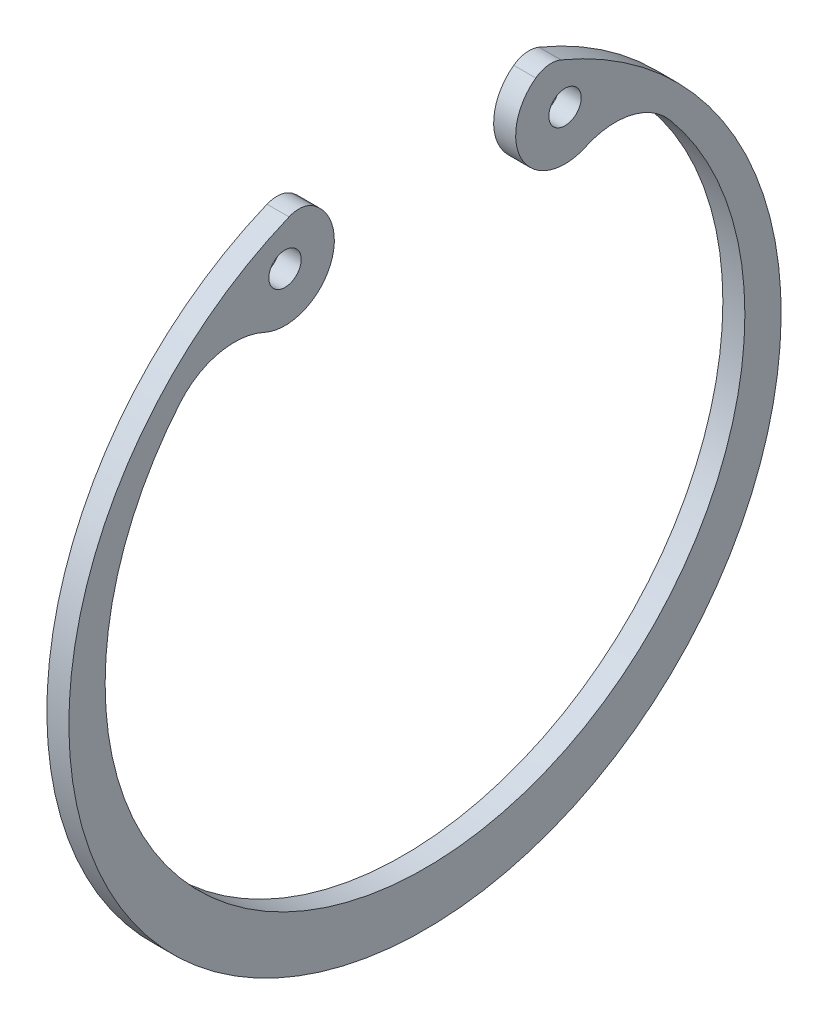
ISO-10303-21;
HEADER;
FILE_DESCRIPTION(('STEP AP214'),'2;1');
FILE_NAME('part.step','',(''),(''),'','','');
FILE_SCHEMA(('AUTOMOTIVE_DESIGN { 1 0 10303 214 1 1 1 1 }'));
ENDSEC;
DATA;
#1=APPLICATION_CONTEXT('core data for automotive mechanical design processes');
#2=APPLICATION_PROTOCOL_DEFINITION('international standard','automotive_design',2000,#1);
#3=PRODUCT_CONTEXT('',#1,'mechanical');
#4=PRODUCT('Part','Part','',(#3));
#5=PRODUCT_RELATED_PRODUCT_CATEGORY('part','',(#4));
#6=PRODUCT_DEFINITION_FORMATION('','',#4);
#7=PRODUCT_DEFINITION_CONTEXT('part definition',#1,'design');
#8=PRODUCT_DEFINITION('design','',#6,#7);
#9=PRODUCT_DEFINITION_SHAPE('','',#8);
#10=(LENGTH_UNIT() NAMED_UNIT(*) SI_UNIT(.MILLI.,.METRE.));
#11=(NAMED_UNIT(*) PLANE_ANGLE_UNIT() SI_UNIT($,.RADIAN.));
#12=(NAMED_UNIT(*) SI_UNIT($,.STERADIAN.) SOLID_ANGLE_UNIT());
#13=UNCERTAINTY_MEASURE_WITH_UNIT(LENGTH_MEASURE(1.E-05),#10,'distance_accuracy_value','');
#14=(GEOMETRIC_REPRESENTATION_CONTEXT(3) GLOBAL_UNCERTAINTY_ASSIGNED_CONTEXT((#13)) GLOBAL_UNIT_ASSIGNED_CONTEXT((#10,
#11,#12)) REPRESENTATION_CONTEXT('',''));
#15=CARTESIAN_POINT('',(0.,0.,0.));
#16=DIRECTION('',(0.,0.,1.));
#17=DIRECTION('',(1.,0.,0.));
#18=AXIS2_PLACEMENT_3D('',#15,#16,#17);
#19=CARTESIAN_POINT('',(1.7,11.7838280929559,4.86866465015439));
#20=DIRECTION('',(1.,0.,0.));
#21=DIRECTION('',(0.,0.,-1.));
#22=AXIS2_PLACEMENT_3D('',#19,#20,#21);
#23=PLANE('',#22);
#24=CARTESIAN_POINT('',(1.7,22.1092965197219,-10.8109055288764));
#25=DIRECTION('',(1.,0.,0.));
#26=DIRECTION('',(0.,0.,-1.));
#27=AXIS2_PLACEMENT_3D('',#24,#25,#26);
#28=CIRCLE('',#27,1.25);
#29=CARTESIAN_POINT('',(1.7,22.1092965197219,-12.0609055288764));
#30=VERTEX_POINT('',#29);
#31=EDGE_CURVE('E138',#30,#30,#28,.T.);
#32=ORIENTED_EDGE('',*,*,#31,.F.);
#33=EDGE_LOOP('',(#32));
#34=FACE_BOUND('',#33,.T.);
#35=CARTESIAN_POINT('',(1.7,23.5676561859118,9.73732930030878));
#36=DIRECTION('',(1.,0.,0.));
#37=DIRECTION('',(0.,0.,-1.));
#38=AXIS2_PLACEMENT_3D('',#35,#36,#37);
#39=CIRCLE('',#38,2.);
#40=CARTESIAN_POINT('',(1.7,25.1782975395719,8.5516504104401));
#41=VERTEX_POINT('',#40);
#42=CARTESIAN_POINT('',(1.7,25.4160998083363,10.5010414022938));
#43=VERTEX_POINT('',#42);
#44=EDGE_CURVE('E149',#41,#43,#39,.T.);
#45=ORIENTED_EDGE('',*,*,#44,.T.);
#46=CARTESIAN_POINT('',(1.7,0.,0.));
#47=DIRECTION('',(1.,0.,0.));
#48=DIRECTION('',(0.,0.,-1.));
#49=AXIS2_PLACEMENT_3D('',#46,#47,#48);
#50=CIRCLE('',#49,27.5);
#51=CARTESIAN_POINT('',(1.7,25.4160998083363,-10.5010414022938));
#52=VERTEX_POINT('',#51);
#53=EDGE_CURVE('E97',#43,#52,#50,.T.);
#54=ORIENTED_EDGE('',*,*,#53,.T.);
#55=CARTESIAN_POINT('',(1.7,23.5676561859118,-9.73732930030877));
#56=DIRECTION('',(1.,0.,0.));
#57=DIRECTION('',(0.,0.,1.));
#58=AXIS2_PLACEMENT_3D('',#55,#56,#57);
#59=CIRCLE('',#58,2.);
#60=CARTESIAN_POINT('',(1.7,25.1782975395718,-8.55165041044009));
#61=VERTEX_POINT('',#60);
#62=EDGE_CURVE('E164',#52,#61,#59,.T.);
#63=ORIENTED_EDGE('',*,*,#62,.T.);
#64=CARTESIAN_POINT('',(1.7,22.1092965197219,-10.8109055288764));
#65=DIRECTION('',(1.,0.,0.));
#66=DIRECTION('',(0.,0.,-1.));
#67=AXIS2_PLACEMENT_3D('',#64,#65,#66);
#68=CIRCLE('',#67,3.81090552887636);
#69=CARTESIAN_POINT('',(1.7,18.6469338912183,-12.4030883006591));
#70=VERTEX_POINT('',#69);
#71=EDGE_CURVE('E177',#61,#70,#68,.T.);
#72=ORIENTED_EDGE('',*,*,#71,.T.);
#73=CARTESIAN_POINT('',(1.7,13.6499602553001,-14.7009687331314));
#74=DIRECTION('',(-1.,0.,0.));
#75=DIRECTION('',(0.,0.,-1.));
#76=AXIS2_PLACEMENT_3D('',#73,#74,#75);
#77=CIRCLE('',#76,5.5);
#78=CARTESIAN_POINT('',(1.7,17.1877092867663,-18.9121837348097));
#79=VERTEX_POINT('',#78);
#80=EDGE_CURVE('E116',#70,#79,#77,.T.);
#81=ORIENTED_EDGE('',*,*,#80,.T.);
#82=CARTESIAN_POINT('',(1.7,1.3,0.));
#83=DIRECTION('',(-1.,0.,0.));
#84=DIRECTION('',(0.,0.,-1.));
#85=AXIS2_PLACEMENT_3D('',#82,#83,#84);
#86=CIRCLE('',#85,24.7);
#87=CARTESIAN_POINT('',(1.7,17.1877092867663,18.9121837348097));
#88=VERTEX_POINT('',#87);
#89=EDGE_CURVE('E110',#79,#88,#86,.T.);
#90=ORIENTED_EDGE('',*,*,#89,.T.);
#91=CARTESIAN_POINT('',(1.7,13.6499602553001,14.7009687331314));
#92=DIRECTION('',(-1.,0.,0.));
#93=DIRECTION('',(0.,0.,1.));
#94=AXIS2_PLACEMENT_3D('',#91,#92,#93);
#95=CIRCLE('',#94,5.5);
#96=CARTESIAN_POINT('',(1.7,18.6469338912183,12.4030883006591));
#97=VERTEX_POINT('',#96);
#98=EDGE_CURVE('E114',#88,#97,#95,.T.);
#99=ORIENTED_EDGE('',*,*,#98,.T.);
#100=CARTESIAN_POINT('',(1.7,22.1092965197219,10.8109055288764));
#101=DIRECTION('',(1.,0.,0.));
#102=DIRECTION('',(0.,0.,1.));
#103=AXIS2_PLACEMENT_3D('',#100,#101,#102);
#104=CIRCLE('',#103,3.81090552887636);
#105=EDGE_CURVE('E54',#97,#41,#104,.T.);
#106=ORIENTED_EDGE('',*,*,#105,.T.);
#107=EDGE_LOOP('',(#45,#54,#63,#72,#81,#90,#99,#106));
#108=FACE_BOUND('',#107,.T.);
#109=CARTESIAN_POINT('',(1.7,22.1092965197219,10.8109055288764));
#110=DIRECTION('',(1.,0.,0.));
#111=DIRECTION('',(0.,0.,1.));
#112=AXIS2_PLACEMENT_3D('',#109,#110,#111);
#113=CIRCLE('',#112,1.25);
#114=CARTESIAN_POINT('',(1.7,22.1092965197219,12.0609055288764));
#115=VERTEX_POINT('',#114);
#116=EDGE_CURVE('E186',#115,#115,#113,.T.);
#117=ORIENTED_EDGE('',*,*,#116,.F.);
#118=EDGE_LOOP('',(#117));
#119=FACE_BOUND('',#118,.T.);
#120=ADVANCED_FACE('F37',(#34,#108,#119),#23,.T.);
#121=CARTESIAN_POINT('',(0.,11.7838280929559,4.86866465015439));
#122=DIRECTION('',(1.,0.,0.));
#123=DIRECTION('',(0.,0.,-1.));
#124=AXIS2_PLACEMENT_3D('',#121,#122,#123);
#125=PLANE('',#124);
#126=CARTESIAN_POINT('',(0.,23.5676561859118,9.73732930030878));
#127=DIRECTION('',(1.,0.,0.));
#128=DIRECTION('',(0.,0.,-1.));
#129=AXIS2_PLACEMENT_3D('',#126,#127,#128);
#130=CIRCLE('',#129,2.);
#131=CARTESIAN_POINT('',(0.,25.1782975395719,8.5516504104401));
#132=VERTEX_POINT('',#131);
#133=CARTESIAN_POINT('',(0.,25.4160998083363,10.5010414022938));
#134=VERTEX_POINT('',#133);
#135=EDGE_CURVE('E134',#132,#134,#130,.T.);
#136=ORIENTED_EDGE('',*,*,#135,.F.);
#137=CARTESIAN_POINT('',(0.,22.1092965197219,10.8109055288764));
#138=DIRECTION('',(1.,0.,0.));
#139=DIRECTION('',(0.,0.,1.));
#140=AXIS2_PLACEMENT_3D('',#137,#138,#139);
#141=CIRCLE('',#140,3.81090552887636);
#142=CARTESIAN_POINT('',(0.,18.6469338912183,12.4030883006591));
#143=VERTEX_POINT('',#142);
#144=EDGE_CURVE('E89',#143,#132,#141,.T.);
#145=ORIENTED_EDGE('',*,*,#144,.F.);
#146=CARTESIAN_POINT('',(0.,13.6499602553001,14.7009687331314));
#147=DIRECTION('',(-1.,0.,0.));
#148=DIRECTION('',(0.,0.,1.));
#149=AXIS2_PLACEMENT_3D('',#146,#147,#148);
#150=CIRCLE('',#149,5.5);
#151=CARTESIAN_POINT('',(0.,17.1877092867663,18.9121837348097));
#152=VERTEX_POINT('',#151);
#153=EDGE_CURVE('E83',#152,#143,#150,.T.);
#154=ORIENTED_EDGE('',*,*,#153,.F.);
#155=CARTESIAN_POINT('',(0.,1.3,0.));
#156=DIRECTION('',(-1.,0.,0.));
#157=DIRECTION('',(0.,0.,-1.));
#158=AXIS2_PLACEMENT_3D('',#155,#156,#157);
#159=CIRCLE('',#158,24.7);
#160=CARTESIAN_POINT('',(0.,17.1877092867663,-18.9121837348097));
#161=VERTEX_POINT('',#160);
#162=EDGE_CURVE('E124',#161,#152,#159,.T.);
#163=ORIENTED_EDGE('',*,*,#162,.F.);
#164=CARTESIAN_POINT('',(0.,13.6499602553001,-14.7009687331314));
#165=DIRECTION('',(-1.,0.,0.));
#166=DIRECTION('',(0.,0.,-1.));
#167=AXIS2_PLACEMENT_3D('',#164,#165,#166);
#168=CIRCLE('',#167,5.5);
#169=CARTESIAN_POINT('',(0.,18.6469338912183,-12.4030883006591));
#170=VERTEX_POINT('',#169);
#171=EDGE_CURVE('E144',#170,#161,#168,.T.);
#172=ORIENTED_EDGE('',*,*,#171,.F.);
#173=CARTESIAN_POINT('',(0.,22.1092965197219,-10.8109055288764));
#174=DIRECTION('',(1.,0.,0.));
#175=DIRECTION('',(0.,0.,-1.));
#176=AXIS2_PLACEMENT_3D('',#173,#174,#175);
#177=CIRCLE('',#176,3.81090552887636);
#178=CARTESIAN_POINT('',(0.,25.1782975395718,-8.55165041044009));
#179=VERTEX_POINT('',#178);
#180=EDGE_CURVE('E142',#179,#170,#177,.T.);
#181=ORIENTED_EDGE('',*,*,#180,.F.);
#182=CARTESIAN_POINT('',(0.,23.5676561859118,-9.73732930030877));
#183=DIRECTION('',(1.,0.,0.));
#184=DIRECTION('',(0.,0.,1.));
#185=AXIS2_PLACEMENT_3D('',#182,#183,#184);
#186=CIRCLE('',#185,2.);
#187=CARTESIAN_POINT('',(0.,25.4160998083363,-10.5010414022938));
#188=VERTEX_POINT('',#187);
#189=EDGE_CURVE('E140',#188,#179,#186,.T.);
#190=ORIENTED_EDGE('',*,*,#189,.F.);
#191=CARTESIAN_POINT('',(0.,0.,0.));
#192=DIRECTION('',(1.,0.,0.));
#193=DIRECTION('',(0.,0.,-1.));
#194=AXIS2_PLACEMENT_3D('',#191,#192,#193);
#195=CIRCLE('',#194,27.5);
#196=EDGE_CURVE('E137',#134,#188,#195,.T.);
#197=ORIENTED_EDGE('',*,*,#196,.F.);
#198=EDGE_LOOP('',(#136,#145,#154,#163,#172,#181,#190,#197));
#199=FACE_BOUND('',#198,.T.);
#200=CARTESIAN_POINT('',(0.,22.1092965197219,-10.8109055288764));
#201=DIRECTION('',(1.,0.,0.));
#202=DIRECTION('',(0.,0.,-1.));
#203=AXIS2_PLACEMENT_3D('',#200,#201,#202);
#204=CIRCLE('',#203,1.25);
#205=CARTESIAN_POINT('',(0.,22.1092965197219,-12.0609055288764));
#206=VERTEX_POINT('',#205);
#207=EDGE_CURVE('E183',#206,#206,#204,.T.);
#208=ORIENTED_EDGE('',*,*,#207,.T.);
#209=EDGE_LOOP('',(#208));
#210=FACE_BOUND('',#209,.T.);
#211=CARTESIAN_POINT('',(0.,22.1092965197219,10.8109055288764));
#212=DIRECTION('',(1.,0.,0.));
#213=DIRECTION('',(0.,0.,1.));
#214=AXIS2_PLACEMENT_3D('',#211,#212,#213);
#215=CIRCLE('',#214,1.25);
#216=CARTESIAN_POINT('',(0.,22.1092965197219,12.0609055288764));
#217=VERTEX_POINT('',#216);
#218=EDGE_CURVE('E189',#217,#217,#215,.T.);
#219=ORIENTED_EDGE('',*,*,#218,.T.);
#220=EDGE_LOOP('',(#219));
#221=FACE_BOUND('',#220,.T.);
#222=ADVANCED_FACE('F168',(#199,#210,#221),#125,.F.);
#223=CARTESIAN_POINT('',(1.7,23.5676561859118,9.73732930030878));
#224=DIRECTION('',(-1.,0.,0.));
#225=DIRECTION('',(0.,0.,1.));
#226=AXIS2_PLACEMENT_3D('',#223,#224,#225);
#227=CYLINDRICAL_SURFACE('',#226,2.);
#228=ORIENTED_EDGE('',*,*,#135,.T.);
#229=DIRECTION('',(-1.,0.,0.));
#230=VECTOR('',#229,1.);
#231=CARTESIAN_POINT('',(1.7,25.4160998083363,10.5010414022938));
#232=LINE('',#231,#230);
#233=EDGE_CURVE('E11',#43,#134,#232,.T.);
#234=ORIENTED_EDGE('',*,*,#233,.F.);
#235=ORIENTED_EDGE('',*,*,#44,.F.);
#236=DIRECTION('',(-1.,0.,0.));
#237=VECTOR('',#236,1.);
#238=CARTESIAN_POINT('',(1.7,25.1782975395719,8.5516504104401));
#239=LINE('',#238,#237);
#240=EDGE_CURVE('E130',#41,#132,#239,.T.);
#241=ORIENTED_EDGE('',*,*,#240,.T.);
#242=EDGE_LOOP('',(#228,#234,#235,#241));
#243=FACE_BOUND('',#242,.T.);
#244=ADVANCED_FACE('F39',(#243),#227,.T.);
#245=CARTESIAN_POINT('',(1.7,0.,0.));
#246=DIRECTION('',(-1.,0.,0.));
#247=DIRECTION('',(0.,0.,1.));
#248=AXIS2_PLACEMENT_3D('',#245,#246,#247);
#249=CYLINDRICAL_SURFACE('',#248,27.5);
#250=ORIENTED_EDGE('',*,*,#196,.T.);
#251=DIRECTION('',(-1.,0.,0.));
#252=VECTOR('',#251,1.);
#253=CARTESIAN_POINT('',(1.7,25.4160998083363,-10.5010414022938));
#254=LINE('',#253,#252);
#255=EDGE_CURVE('E46',#52,#188,#254,.T.);
#256=ORIENTED_EDGE('',*,*,#255,.F.);
#257=ORIENTED_EDGE('',*,*,#53,.F.);
#258=ORIENTED_EDGE('',*,*,#233,.T.);
#259=EDGE_LOOP('',(#250,#256,#257,#258));
#260=FACE_BOUND('',#259,.T.);
#261=ADVANCED_FACE('F221',(#260),#249,.T.);
#262=CARTESIAN_POINT('',(1.7,23.5676561859118,-9.73732930030877));
#263=DIRECTION('',(-1.,0.,0.));
#264=DIRECTION('',(0.,0.,1.));
#265=AXIS2_PLACEMENT_3D('',#262,#263,#264);
#266=CYLINDRICAL_SURFACE('',#265,2.);
#267=ORIENTED_EDGE('',*,*,#189,.T.);
#268=DIRECTION('',(-1.,0.,0.));
#269=VECTOR('',#268,1.);
#270=CARTESIAN_POINT('',(1.7,25.1782975395718,-8.55165041044009));
#271=LINE('',#270,#269);
#272=EDGE_CURVE('E156',#61,#179,#271,.T.);
#273=ORIENTED_EDGE('',*,*,#272,.F.);
#274=ORIENTED_EDGE('',*,*,#62,.F.);
#275=ORIENTED_EDGE('',*,*,#255,.T.);
#276=EDGE_LOOP('',(#267,#273,#274,#275));
#277=FACE_BOUND('',#276,.T.);
#278=ADVANCED_FACE('F162',(#277),#266,.T.);
#279=CARTESIAN_POINT('',(1.7,22.1092965197219,-10.8109055288764));
#280=DIRECTION('',(-1.,0.,0.));
#281=DIRECTION('',(0.,0.,1.));
#282=AXIS2_PLACEMENT_3D('',#279,#280,#281);
#283=CYLINDRICAL_SURFACE('',#282,3.81090552887636);
#284=ORIENTED_EDGE('',*,*,#180,.T.);
#285=DIRECTION('',(-1.,0.,0.));
#286=VECTOR('',#285,1.);
#287=CARTESIAN_POINT('',(1.7,18.6469338912183,-12.4030883006591));
#288=LINE('',#287,#286);
#289=EDGE_CURVE('E153',#70,#170,#288,.T.);
#290=ORIENTED_EDGE('',*,*,#289,.F.);
#291=ORIENTED_EDGE('',*,*,#71,.F.);
#292=ORIENTED_EDGE('',*,*,#272,.T.);
#293=EDGE_LOOP('',(#284,#290,#291,#292));
#294=FACE_BOUND('',#293,.T.);
#295=ADVANCED_FACE('F173',(#294),#283,.T.);
#296=CARTESIAN_POINT('',(1.7,13.6499602553001,-14.7009687331314));
#297=DIRECTION('',(-1.,0.,0.));
#298=DIRECTION('',(0.,0.,1.));
#299=AXIS2_PLACEMENT_3D('',#296,#297,#298);
#300=CYLINDRICAL_SURFACE('',#299,5.5);
#301=ORIENTED_EDGE('',*,*,#171,.T.);
#302=DIRECTION('',(-1.,0.,0.));
#303=VECTOR('',#302,1.);
#304=CARTESIAN_POINT('',(1.7,17.1877092867663,-18.9121837348097));
#305=LINE('',#304,#303);
#306=EDGE_CURVE('E125',#79,#161,#305,.T.);
#307=ORIENTED_EDGE('',*,*,#306,.F.);
#308=ORIENTED_EDGE('',*,*,#80,.F.);
#309=ORIENTED_EDGE('',*,*,#289,.T.);
#310=EDGE_LOOP('',(#301,#307,#308,#309));
#311=FACE_BOUND('',#310,.T.);
#312=ADVANCED_FACE('F176',(#311),#300,.F.);
#313=CARTESIAN_POINT('',(1.7,1.3,0.));
#314=DIRECTION('',(-1.,0.,0.));
#315=DIRECTION('',(0.,0.,1.));
#316=AXIS2_PLACEMENT_3D('',#313,#314,#315);
#317=CYLINDRICAL_SURFACE('',#316,24.7);
#318=ORIENTED_EDGE('',*,*,#162,.T.);
#319=DIRECTION('',(-1.,0.,0.));
#320=VECTOR('',#319,1.);
#321=CARTESIAN_POINT('',(1.7,17.1877092867663,18.9121837348097));
#322=LINE('',#321,#320);
#323=EDGE_CURVE('E121',#88,#152,#322,.T.);
#324=ORIENTED_EDGE('',*,*,#323,.F.);
#325=ORIENTED_EDGE('',*,*,#89,.F.);
#326=ORIENTED_EDGE('',*,*,#306,.T.);
#327=EDGE_LOOP('',(#318,#324,#325,#326));
#328=FACE_BOUND('',#327,.T.);
#329=ADVANCED_FACE('F122',(#328),#317,.F.);
#330=CARTESIAN_POINT('',(1.7,13.6499602553001,14.7009687331314));
#331=DIRECTION('',(-1.,0.,0.));
#332=DIRECTION('',(0.,0.,1.));
#333=AXIS2_PLACEMENT_3D('',#330,#331,#332);
#334=CYLINDRICAL_SURFACE('',#333,5.5);
#335=ORIENTED_EDGE('',*,*,#153,.T.);
#336=DIRECTION('',(-1.,0.,0.));
#337=VECTOR('',#336,1.);
#338=CARTESIAN_POINT('',(1.7,18.6469338912183,12.4030883006591));
#339=LINE('',#338,#337);
#340=EDGE_CURVE('E126',#97,#143,#339,.T.);
#341=ORIENTED_EDGE('',*,*,#340,.F.);
#342=ORIENTED_EDGE('',*,*,#98,.F.);
#343=ORIENTED_EDGE('',*,*,#323,.T.);
#344=EDGE_LOOP('',(#335,#341,#342,#343));
#345=FACE_BOUND('',#344,.T.);
#346=ADVANCED_FACE('F128',(#345),#334,.F.);
#347=CARTESIAN_POINT('',(1.7,22.1092965197219,10.8109055288764));
#348=DIRECTION('',(-1.,0.,0.));
#349=DIRECTION('',(0.,0.,1.));
#350=AXIS2_PLACEMENT_3D('',#347,#348,#349);
#351=CYLINDRICAL_SURFACE('',#350,3.81090552887636);
#352=ORIENTED_EDGE('',*,*,#144,.T.);
#353=ORIENTED_EDGE('',*,*,#240,.F.);
#354=ORIENTED_EDGE('',*,*,#105,.F.);
#355=ORIENTED_EDGE('',*,*,#340,.T.);
#356=EDGE_LOOP('',(#352,#353,#354,#355));
#357=FACE_BOUND('',#356,.T.);
#358=ADVANCED_FACE('F209',(#357),#351,.T.);
#359=CARTESIAN_POINT('',(1.7,22.1092965197219,-10.8109055288764));
#360=DIRECTION('',(-1.,0.,0.));
#361=DIRECTION('',(0.,0.,1.));
#362=AXIS2_PLACEMENT_3D('',#359,#360,#361);
#363=CYLINDRICAL_SURFACE('',#362,1.25);
#364=ORIENTED_EDGE('',*,*,#31,.T.);
#365=EDGE_LOOP('',(#364));
#366=FACE_BOUND('',#365,.T.);
#367=ORIENTED_EDGE('',*,*,#207,.F.);
#368=EDGE_LOOP('',(#367));
#369=FACE_BOUND('',#368,.T.);
#370=ADVANCED_FACE('F206',(#366,#369),#363,.F.);
#371=CARTESIAN_POINT('',(1.7,22.1092965197219,10.8109055288764));
#372=DIRECTION('',(-1.,0.,0.));
#373=DIRECTION('',(0.,0.,1.));
#374=AXIS2_PLACEMENT_3D('',#371,#372,#373);
#375=CYLINDRICAL_SURFACE('',#374,1.25);
#376=ORIENTED_EDGE('',*,*,#116,.T.);
#377=EDGE_LOOP('',(#376));
#378=FACE_BOUND('',#377,.T.);
#379=ORIENTED_EDGE('',*,*,#218,.F.);
#380=EDGE_LOOP('',(#379));
#381=FACE_BOUND('',#380,.T.);
#382=ADVANCED_FACE('F195',(#378,#381),#375,.F.);
#383=CLOSED_SHELL('',(#120,#222,#244,#261,#278,#295,#312,#329,#346,#358,#370,#382));
#384=MANIFOLD_SOLID_BREP('B2',#383);
#385=ADVANCED_BREP_SHAPE_REPRESENTATION('',(#18,#384),#14);
#386=SHAPE_DEFINITION_REPRESENTATION(#9,#385);
ENDSEC;
END-ISO-10303-21;
